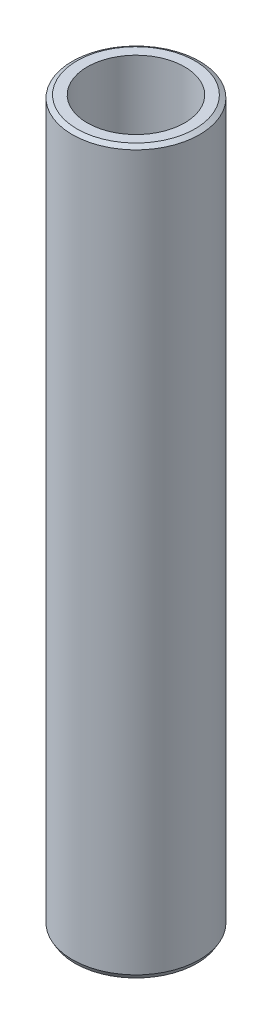
ISO-10303-21;
HEADER;
FILE_DESCRIPTION(('STEP AP214'),'2;1');
FILE_NAME('part.step','',(''),(''),'','','');
FILE_SCHEMA(('AUTOMOTIVE_DESIGN { 1 0 10303 214 1 1 1 1 }'));
ENDSEC;
DATA;
#1=APPLICATION_CONTEXT('core data for automotive mechanical design processes');
#2=APPLICATION_PROTOCOL_DEFINITION('international standard','automotive_design',2000,#1);
#3=PRODUCT_CONTEXT('',#1,'mechanical');
#4=PRODUCT('Part','Part','',(#3));
#5=PRODUCT_RELATED_PRODUCT_CATEGORY('part','',(#4));
#6=PRODUCT_DEFINITION_FORMATION('','',#4);
#7=PRODUCT_DEFINITION_CONTEXT('part definition',#1,'design');
#8=PRODUCT_DEFINITION('design','',#6,#7);
#9=PRODUCT_DEFINITION_SHAPE('','',#8);
#10=(LENGTH_UNIT() NAMED_UNIT(*) SI_UNIT(.MILLI.,.METRE.));
#11=(NAMED_UNIT(*) PLANE_ANGLE_UNIT() SI_UNIT($,.RADIAN.));
#12=(NAMED_UNIT(*) SI_UNIT($,.STERADIAN.) SOLID_ANGLE_UNIT());
#13=UNCERTAINTY_MEASURE_WITH_UNIT(LENGTH_MEASURE(1.E-05),#10,'distance_accuracy_value','');
#14=(GEOMETRIC_REPRESENTATION_CONTEXT(3) GLOBAL_UNCERTAINTY_ASSIGNED_CONTEXT((#13)) GLOBAL_UNIT_ASSIGNED_CONTEXT((#10,
#11,#12)) REPRESENTATION_CONTEXT('',''));
#15=CARTESIAN_POINT('',(0.,0.,0.));
#16=DIRECTION('',(0.,0.,1.));
#17=DIRECTION('',(1.,0.,0.));
#18=AXIS2_PLACEMENT_3D('',#15,#16,#17);
#19=CARTESIAN_POINT('',(0.,397.038890578741,0.));
#20=DIRECTION('',(0.,-1.,0.));
#21=DIRECTION('',(0.,0.,-1.));
#22=AXIS2_PLACEMENT_3D('',#19,#20,#21);
#23=CYLINDRICAL_SURFACE('',#22,35.);
#24=CARTESIAN_POINT('',(0.,395.573278065118,0.));
#25=DIRECTION('',(0.,1.,0.));
#26=DIRECTION('',(0.,0.,1.));
#27=AXIS2_PLACEMENT_3D('',#24,#25,#26);
#28=CIRCLE('',#27,35.);
#29=CARTESIAN_POINT('',(0.,395.573278065118,35.));
#30=VERTEX_POINT('',#29);
#31=EDGE_CURVE('E50',#30,#30,#28,.F.);
#32=ORIENTED_EDGE('',*,*,#31,.T.);
#33=EDGE_LOOP('',(#32));
#34=FACE_BOUND('',#33,.T.);
#35=CARTESIAN_POINT('',(0.,2.53851533780364,0.));
#36=DIRECTION('',(0.,1.,0.));
#37=DIRECTION('',(0.,0.,1.));
#38=AXIS2_PLACEMENT_3D('',#35,#36,#37);
#39=CIRCLE('',#38,35.);
#40=CARTESIAN_POINT('',(0.,2.53851533780364,35.));
#41=VERTEX_POINT('',#40);
#42=EDGE_CURVE('E51',#41,#41,#39,.T.);
#43=ORIENTED_EDGE('',*,*,#42,.T.);
#44=EDGE_LOOP('',(#43));
#45=FACE_BOUND('',#44,.T.);
#46=ADVANCED_FACE('F39',(#34,#45),#23,.T.);
#47=CARTESIAN_POINT('',(0.,397.038890578741,0.));
#48=DIRECTION('',(0.,1.,0.));
#49=DIRECTION('',(0.,0.,1.));
#50=AXIS2_PLACEMENT_3D('',#47,#48,#49);
#51=PLANE('',#50);
#52=CARTESIAN_POINT('',(0.,397.038890578741,0.));
#53=DIRECTION('',(0.,1.,0.));
#54=DIRECTION('',(0.,0.,1.));
#55=AXIS2_PLACEMENT_3D('',#52,#53,#54);
#56=CIRCLE('',#55,32.4614846621964);
#57=CARTESIAN_POINT('',(0.,397.038890578741,32.4614846621964));
#58=VERTEX_POINT('',#57);
#59=EDGE_CURVE('E54',#58,#58,#56,.T.);
#60=ORIENTED_EDGE('',*,*,#59,.T.);
#61=EDGE_LOOP('',(#60));
#62=FACE_BOUND('',#61,.T.);
#63=CARTESIAN_POINT('',(0.,397.038890578741,0.));
#64=DIRECTION('',(0.,1.,0.));
#65=DIRECTION('',(0.,0.,1.));
#66=AXIS2_PLACEMENT_3D('',#63,#64,#65);
#67=CIRCLE('',#66,26.7614062272343);
#68=CARTESIAN_POINT('',(0.,397.038890578741,26.7614062272343));
#69=VERTEX_POINT('',#68);
#70=EDGE_CURVE('E58',#69,#69,#67,.T.);
#71=ORIENTED_EDGE('',*,*,#70,.F.);
#72=EDGE_LOOP('',(#71));
#73=FACE_BOUND('',#72,.T.);
#74=ADVANCED_FACE('F69',(#62,#73),#51,.T.);
#75=CARTESIAN_POINT('',(0.,0.,0.));
#76=DIRECTION('',(0.,1.,0.));
#77=DIRECTION('',(0.,0.,1.));
#78=AXIS2_PLACEMENT_3D('',#75,#76,#77);
#79=PLANE('',#78);
#80=CARTESIAN_POINT('',(0.,0.,0.));
#81=DIRECTION('',(0.,1.,0.));
#82=DIRECTION('',(0.,0.,1.));
#83=AXIS2_PLACEMENT_3D('',#80,#81,#82);
#84=CIRCLE('',#83,33.5343874863771);
#85=CARTESIAN_POINT('',(0.,0.,33.5343874863771));
#86=VERTEX_POINT('',#85);
#87=EDGE_CURVE('E10',#86,#86,#84,.F.);
#88=ORIENTED_EDGE('',*,*,#87,.T.);
#89=EDGE_LOOP('',(#88));
#90=FACE_BOUND('',#89,.T.);
#91=CARTESIAN_POINT('',(0.,0.,0.));
#92=DIRECTION('',(0.,1.,0.));
#93=DIRECTION('',(0.,0.,1.));
#94=AXIS2_PLACEMENT_3D('',#91,#92,#93);
#95=CIRCLE('',#94,26.7614062272343);
#96=CARTESIAN_POINT('',(0.,0.,26.7614062272343));
#97=VERTEX_POINT('',#96);
#98=EDGE_CURVE('E63',#97,#97,#95,.T.);
#99=ORIENTED_EDGE('',*,*,#98,.T.);
#100=EDGE_LOOP('',(#99));
#101=FACE_BOUND('',#100,.T.);
#102=ADVANCED_FACE('F75',(#90,#101),#79,.F.);
#103=CARTESIAN_POINT('',(0.,397.038890578741,0.));
#104=DIRECTION('',(0.,-1.,0.));
#105=DIRECTION('',(0.,0.,-1.));
#106=AXIS2_PLACEMENT_3D('',#103,#104,#105);
#107=CYLINDRICAL_SURFACE('',#106,26.7614062272343);
#108=ORIENTED_EDGE('',*,*,#70,.T.);
#109=EDGE_LOOP('',(#108));
#110=FACE_BOUND('',#109,.T.);
#111=ORIENTED_EDGE('',*,*,#98,.F.);
#112=EDGE_LOOP('',(#111));
#113=FACE_BOUND('',#112,.T.);
#114=ADVANCED_FACE('F70',(#110,#113),#107,.F.);
#115=CARTESIAN_POINT('',(0.,397.038890578741,0.));
#116=DIRECTION('',(0.,-1.,0.));
#117=DIRECTION('',(0.,0.,-1.));
#118=AXIS2_PLACEMENT_3D('',#115,#116,#117);
#119=CONICAL_SURFACE('',#118,32.4614846621964,1.04719755119658);
#120=ORIENTED_EDGE('',*,*,#31,.F.);
#121=EDGE_LOOP('',(#120));
#122=FACE_BOUND('',#121,.T.);
#123=ORIENTED_EDGE('',*,*,#59,.F.);
#124=EDGE_LOOP('',(#123));
#125=FACE_BOUND('',#124,.T.);
#126=ADVANCED_FACE('F81',(#122,#125),#119,.T.);
#127=CARTESIAN_POINT('',(0.,2.53851533780364,0.));
#128=DIRECTION('',(0.,1.,0.));
#129=DIRECTION('',(0.,0.,1.));
#130=AXIS2_PLACEMENT_3D('',#127,#128,#129);
#131=CONICAL_SURFACE('',#130,35.,0.523598775598302);
#132=ORIENTED_EDGE('',*,*,#87,.F.);
#133=EDGE_LOOP('',(#132));
#134=FACE_BOUND('',#133,.T.);
#135=ORIENTED_EDGE('',*,*,#42,.F.);
#136=EDGE_LOOP('',(#135));
#137=FACE_BOUND('',#136,.T.);
#138=ADVANCED_FACE('F45',(#134,#137),#131,.T.);
#139=CLOSED_SHELL('',(#46,#74,#102,#114,#126,#138));
#140=MANIFOLD_SOLID_BREP('B2',#139);
#141=ADVANCED_BREP_SHAPE_REPRESENTATION('',(#18,#140),#14);
#142=SHAPE_DEFINITION_REPRESENTATION(#9,#141);
ENDSEC;
END-ISO-10303-21;
